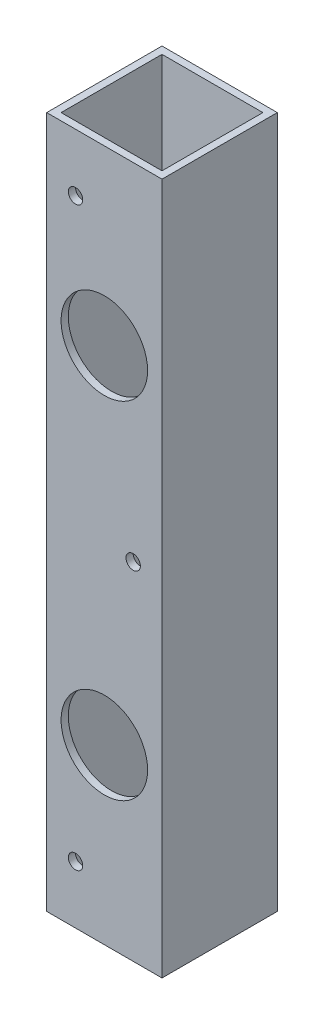
ISO-10303-21;
HEADER;
FILE_DESCRIPTION(('STEP AP214'),'2;1');
FILE_NAME('part.step','',(''),(''),'','','');
FILE_SCHEMA(('AUTOMOTIVE_DESIGN { 1 0 10303 214 1 1 1 1 }'));
ENDSEC;
DATA;
#1=APPLICATION_CONTEXT('core data for automotive mechanical design processes');
#2=APPLICATION_PROTOCOL_DEFINITION('international standard','automotive_design',2000,#1);
#3=PRODUCT_CONTEXT('',#1,'mechanical');
#4=PRODUCT('Part','Part','',(#3));
#5=PRODUCT_RELATED_PRODUCT_CATEGORY('part','',(#4));
#6=PRODUCT_DEFINITION_FORMATION('','',#4);
#7=PRODUCT_DEFINITION_CONTEXT('part definition',#1,'design');
#8=PRODUCT_DEFINITION('design','',#6,#7);
#9=PRODUCT_DEFINITION_SHAPE('','',#8);
#10=(LENGTH_UNIT() NAMED_UNIT(*) SI_UNIT(.MILLI.,.METRE.));
#11=(NAMED_UNIT(*) PLANE_ANGLE_UNIT() SI_UNIT($,.RADIAN.));
#12=(NAMED_UNIT(*) SI_UNIT($,.STERADIAN.) SOLID_ANGLE_UNIT());
#13=UNCERTAINTY_MEASURE_WITH_UNIT(LENGTH_MEASURE(1.E-05),#10,'distance_accuracy_value','');
#14=(GEOMETRIC_REPRESENTATION_CONTEXT(3) GLOBAL_UNCERTAINTY_ASSIGNED_CONTEXT((#13)) GLOBAL_UNIT_ASSIGNED_CONTEXT((#10,
#11,#12)) REPRESENTATION_CONTEXT('',''));
#15=CARTESIAN_POINT('',(0.,0.,0.));
#16=DIRECTION('',(0.,0.,1.));
#17=DIRECTION('',(1.,0.,0.));
#18=AXIS2_PLACEMENT_3D('',#15,#16,#17);
#19=CARTESIAN_POINT('',(0.,152.4,0.));
#20=DIRECTION('',(0.,1.,0.));
#21=DIRECTION('',(0.,0.,1.));
#22=AXIS2_PLACEMENT_3D('',#19,#20,#21);
#23=PLANE('',#22);
#24=DIRECTION('',(0.,0.,1.));
#25=VECTOR('',#24,1.);
#26=CARTESIAN_POINT('',(-12.7,152.4,12.7));
#27=LINE('',#26,#25);
#28=CARTESIAN_POINT('',(-12.7,152.4,-12.7));
#29=VERTEX_POINT('',#28);
#30=CARTESIAN_POINT('',(-12.7,152.4,12.7));
#31=VERTEX_POINT('',#30);
#32=EDGE_CURVE('E159',#29,#31,#27,.T.);
#33=ORIENTED_EDGE('',*,*,#32,.T.);
#34=DIRECTION('',(1.,0.,0.));
#35=VECTOR('',#34,1.);
#36=CARTESIAN_POINT('',(12.7,152.4,12.7));
#37=LINE('',#36,#35);
#38=CARTESIAN_POINT('',(12.7,152.4,12.7));
#39=VERTEX_POINT('',#38);
#40=EDGE_CURVE('E162',#31,#39,#37,.T.);
#41=ORIENTED_EDGE('',*,*,#40,.T.);
#42=DIRECTION('',(0.,0.,-1.));
#43=VECTOR('',#42,1.);
#44=CARTESIAN_POINT('',(12.7,152.4,12.7));
#45=LINE('',#44,#43);
#46=CARTESIAN_POINT('',(12.7,152.4,-12.7));
#47=VERTEX_POINT('',#46);
#48=EDGE_CURVE('E165',#39,#47,#45,.T.);
#49=ORIENTED_EDGE('',*,*,#48,.T.);
#50=DIRECTION('',(-1.,0.,0.));
#51=VECTOR('',#50,1.);
#52=CARTESIAN_POINT('',(12.7,152.4,-12.7));
#53=LINE('',#52,#51);
#54=EDGE_CURVE('E167',#47,#29,#53,.T.);
#55=ORIENTED_EDGE('',*,*,#54,.T.);
#56=EDGE_LOOP('',(#33,#41,#49,#55));
#57=FACE_BOUND('',#56,.T.);
#58=DIRECTION('',(1.,0.,0.));
#59=VECTOR('',#58,1.);
#60=CARTESIAN_POINT('',(12.7,152.4,11.1125));
#61=LINE('',#60,#59);
#62=CARTESIAN_POINT('',(-11.1125,152.4,11.1125));
#63=VERTEX_POINT('',#62);
#64=CARTESIAN_POINT('',(11.1125,152.4,11.1125));
#65=VERTEX_POINT('',#64);
#66=EDGE_CURVE('E129',#63,#65,#61,.T.);
#67=ORIENTED_EDGE('',*,*,#66,.F.);
#68=DIRECTION('',(0.,0.,1.));
#69=VECTOR('',#68,1.);
#70=CARTESIAN_POINT('',(-11.1125,152.4,12.7));
#71=LINE('',#70,#69);
#72=CARTESIAN_POINT('',(-11.1125,152.4,-11.1125));
#73=VERTEX_POINT('',#72);
#74=EDGE_CURVE('E121',#73,#63,#71,.T.);
#75=ORIENTED_EDGE('',*,*,#74,.F.);
#76=DIRECTION('',(-1.,0.,0.));
#77=VECTOR('',#76,1.);
#78=CARTESIAN_POINT('',(12.7,152.4,-11.1125));
#79=LINE('',#78,#77);
#80=CARTESIAN_POINT('',(11.1125,152.4,-11.1125));
#81=VERTEX_POINT('',#80);
#82=EDGE_CURVE('E143',#81,#73,#79,.T.);
#83=ORIENTED_EDGE('',*,*,#82,.F.);
#84=DIRECTION('',(0.,0.,-1.));
#85=VECTOR('',#84,1.);
#86=CARTESIAN_POINT('',(11.1125,152.4,12.7));
#87=LINE('',#86,#85);
#88=EDGE_CURVE('E141',#65,#81,#87,.T.);
#89=ORIENTED_EDGE('',*,*,#88,.F.);
#90=EDGE_LOOP('',(#67,#75,#83,#89));
#91=FACE_BOUND('',#90,.T.);
#92=ADVANCED_FACE('F56',(#57,#91),#23,.T.);
#93=CARTESIAN_POINT('',(0.,0.,0.));
#94=DIRECTION('',(0.,1.,0.));
#95=DIRECTION('',(0.,0.,1.));
#96=AXIS2_PLACEMENT_3D('',#93,#94,#95);
#97=PLANE('',#96);
#98=DIRECTION('',(0.,0.,1.));
#99=VECTOR('',#98,1.);
#100=CARTESIAN_POINT('',(-12.7,0.,12.7));
#101=LINE('',#100,#99);
#102=CARTESIAN_POINT('',(-12.7,0.,-12.7));
#103=VERTEX_POINT('',#102);
#104=CARTESIAN_POINT('',(-12.7,0.,12.7));
#105=VERTEX_POINT('',#104);
#106=EDGE_CURVE('E137',#103,#105,#101,.T.);
#107=ORIENTED_EDGE('',*,*,#106,.F.);
#108=DIRECTION('',(-1.,0.,0.));
#109=VECTOR('',#108,1.);
#110=CARTESIAN_POINT('',(12.7,0.,-12.7));
#111=LINE('',#110,#109);
#112=CARTESIAN_POINT('',(12.7,0.,-12.7));
#113=VERTEX_POINT('',#112);
#114=EDGE_CURVE('E163',#113,#103,#111,.T.);
#115=ORIENTED_EDGE('',*,*,#114,.F.);
#116=DIRECTION('',(0.,0.,-1.));
#117=VECTOR('',#116,1.);
#118=CARTESIAN_POINT('',(12.7,0.,12.7));
#119=LINE('',#118,#117);
#120=CARTESIAN_POINT('',(12.7,0.,12.7));
#121=VERTEX_POINT('',#120);
#122=EDGE_CURVE('E174',#121,#113,#119,.T.);
#123=ORIENTED_EDGE('',*,*,#122,.F.);
#124=DIRECTION('',(1.,0.,0.));
#125=VECTOR('',#124,1.);
#126=CARTESIAN_POINT('',(12.7,0.,12.7));
#127=LINE('',#126,#125);
#128=EDGE_CURVE('E172',#105,#121,#127,.T.);
#129=ORIENTED_EDGE('',*,*,#128,.F.);
#130=EDGE_LOOP('',(#107,#115,#123,#129));
#131=FACE_BOUND('',#130,.T.);
#132=DIRECTION('',(0.,0.,1.));
#133=VECTOR('',#132,1.);
#134=CARTESIAN_POINT('',(-11.1125,0.,12.7));
#135=LINE('',#134,#133);
#136=CARTESIAN_POINT('',(-11.1125,0.,-11.1125));
#137=VERTEX_POINT('',#136);
#138=CARTESIAN_POINT('',(-11.1125,0.,11.1125));
#139=VERTEX_POINT('',#138);
#140=EDGE_CURVE('E79',#137,#139,#135,.T.);
#141=ORIENTED_EDGE('',*,*,#140,.T.);
#142=DIRECTION('',(1.,0.,0.));
#143=VECTOR('',#142,1.);
#144=CARTESIAN_POINT('',(12.7,0.,11.1125));
#145=LINE('',#144,#143);
#146=CARTESIAN_POINT('',(11.1125,0.,11.1125));
#147=VERTEX_POINT('',#146);
#148=EDGE_CURVE('E136',#139,#147,#145,.T.);
#149=ORIENTED_EDGE('',*,*,#148,.T.);
#150=DIRECTION('',(0.,0.,-1.));
#151=VECTOR('',#150,1.);
#152=CARTESIAN_POINT('',(11.1125,0.,12.7));
#153=LINE('',#152,#151);
#154=CARTESIAN_POINT('',(11.1125,0.,-11.1125));
#155=VERTEX_POINT('',#154);
#156=EDGE_CURVE('E151',#147,#155,#153,.T.);
#157=ORIENTED_EDGE('',*,*,#156,.T.);
#158=DIRECTION('',(-1.,0.,0.));
#159=VECTOR('',#158,1.);
#160=CARTESIAN_POINT('',(12.7,0.,-11.1125));
#161=LINE('',#160,#159);
#162=EDGE_CURVE('E130',#155,#137,#161,.T.);
#163=ORIENTED_EDGE('',*,*,#162,.T.);
#164=EDGE_LOOP('',(#141,#149,#157,#163));
#165=FACE_BOUND('',#164,.T.);
#166=ADVANCED_FACE('F192',(#131,#165),#97,.F.);
#167=CARTESIAN_POINT('',(-12.7,152.4,12.7));
#168=DIRECTION('',(1.,0.,0.));
#169=DIRECTION('',(0.,0.,-1.));
#170=AXIS2_PLACEMENT_3D('',#167,#168,#169);
#171=PLANE('',#170);
#172=ORIENTED_EDGE('',*,*,#106,.T.);
#173=DIRECTION('',(0.,-1.,0.));
#174=VECTOR('',#173,1.);
#175=CARTESIAN_POINT('',(-12.7,152.4,12.7));
#176=LINE('',#175,#174);
#177=EDGE_CURVE('E12',#31,#105,#176,.T.);
#178=ORIENTED_EDGE('',*,*,#177,.F.);
#179=ORIENTED_EDGE('',*,*,#32,.F.);
#180=DIRECTION('',(0.,-1.,0.));
#181=VECTOR('',#180,1.);
#182=CARTESIAN_POINT('',(-12.7,152.4,-12.7));
#183=LINE('',#182,#181);
#184=EDGE_CURVE('E169',#29,#103,#183,.T.);
#185=ORIENTED_EDGE('',*,*,#184,.T.);
#186=EDGE_LOOP('',(#172,#178,#179,#185));
#187=FACE_BOUND('',#186,.T.);
#188=ADVANCED_FACE('F58',(#187),#171,.F.);
#189=CARTESIAN_POINT('',(12.7,152.4,12.7));
#190=DIRECTION('',(0.,0.,-1.));
#191=DIRECTION('',(-1.,0.,0.));
#192=AXIS2_PLACEMENT_3D('',#189,#190,#191);
#193=PLANE('',#192);
#194=CARTESIAN_POINT('',(0.,38.1,12.7));
#195=DIRECTION('',(0.,0.,1.));
#196=DIRECTION('',(1.,0.,0.));
#197=AXIS2_PLACEMENT_3D('',#194,#195,#196);
#198=CIRCLE('',#197,9.525);
#199=CARTESIAN_POINT('',(9.525,38.1,12.7));
#200=VERTEX_POINT('',#199);
#201=EDGE_CURVE('E259',#200,#200,#198,.T.);
#202=ORIENTED_EDGE('',*,*,#201,.F.);
#203=EDGE_LOOP('',(#202));
#204=FACE_BOUND('',#203,.T.);
#205=CARTESIAN_POINT('',(-6.35,139.7,12.7));
#206=DIRECTION('',(0.,0.,1.));
#207=DIRECTION('',(1.,0.,0.));
#208=AXIS2_PLACEMENT_3D('',#205,#206,#207);
#209=CIRCLE('',#208,1.5875);
#210=CARTESIAN_POINT('',(-4.7625,139.7,12.7));
#211=VERTEX_POINT('',#210);
#212=EDGE_CURVE('E260',#211,#211,#209,.T.);
#213=ORIENTED_EDGE('',*,*,#212,.F.);
#214=EDGE_LOOP('',(#213));
#215=FACE_BOUND('',#214,.T.);
#216=CARTESIAN_POINT('',(6.35,76.2,12.7));
#217=DIRECTION('',(0.,0.,1.));
#218=DIRECTION('',(1.,0.,0.));
#219=AXIS2_PLACEMENT_3D('',#216,#217,#218);
#220=CIRCLE('',#219,1.5875);
#221=CARTESIAN_POINT('',(7.9375,76.2,12.7));
#222=VERTEX_POINT('',#221);
#223=EDGE_CURVE('E246',#222,#222,#220,.T.);
#224=ORIENTED_EDGE('',*,*,#223,.F.);
#225=EDGE_LOOP('',(#224));
#226=FACE_BOUND('',#225,.T.);
#227=CARTESIAN_POINT('',(-6.35,12.7,12.7));
#228=DIRECTION('',(0.,0.,1.));
#229=DIRECTION('',(1.,0.,0.));
#230=AXIS2_PLACEMENT_3D('',#227,#228,#229);
#231=CIRCLE('',#230,1.5875);
#232=CARTESIAN_POINT('',(-4.7625,12.7,12.7));
#233=VERTEX_POINT('',#232);
#234=EDGE_CURVE('E247',#233,#233,#231,.T.);
#235=ORIENTED_EDGE('',*,*,#234,.F.);
#236=EDGE_LOOP('',(#235));
#237=FACE_BOUND('',#236,.T.);
#238=CARTESIAN_POINT('',(0.,114.3,12.7));
#239=DIRECTION('',(0.,0.,1.));
#240=DIRECTION('',(1.,0.,0.));
#241=AXIS2_PLACEMENT_3D('',#238,#239,#240);
#242=CIRCLE('',#241,9.525);
#243=CARTESIAN_POINT('',(9.525,114.3,12.7));
#244=VERTEX_POINT('',#243);
#245=EDGE_CURVE('E149',#244,#244,#242,.T.);
#246=ORIENTED_EDGE('',*,*,#245,.F.);
#247=EDGE_LOOP('',(#246));
#248=FACE_BOUND('',#247,.T.);
#249=ORIENTED_EDGE('',*,*,#128,.T.);
#250=DIRECTION('',(0.,-1.,0.));
#251=VECTOR('',#250,1.);
#252=CARTESIAN_POINT('',(12.7,152.4,12.7));
#253=LINE('',#252,#251);
#254=EDGE_CURVE('E64',#39,#121,#253,.T.);
#255=ORIENTED_EDGE('',*,*,#254,.F.);
#256=ORIENTED_EDGE('',*,*,#40,.F.);
#257=ORIENTED_EDGE('',*,*,#177,.T.);
#258=EDGE_LOOP('',(#249,#255,#256,#257));
#259=FACE_BOUND('',#258,.T.);
#260=ADVANCED_FACE('F202',(#204,#215,#226,#237,#248,#259),#193,.F.);
#261=CARTESIAN_POINT('',(12.7,152.4,12.7));
#262=DIRECTION('',(-1.,0.,0.));
#263=DIRECTION('',(0.,0.,1.));
#264=AXIS2_PLACEMENT_3D('',#261,#262,#263);
#265=PLANE('',#264);
#266=ORIENTED_EDGE('',*,*,#122,.T.);
#267=DIRECTION('',(0.,-1.,0.));
#268=VECTOR('',#267,1.);
#269=CARTESIAN_POINT('',(12.7,152.4,-12.7));
#270=LINE('',#269,#268);
#271=EDGE_CURVE('E179',#47,#113,#270,.T.);
#272=ORIENTED_EDGE('',*,*,#271,.F.);
#273=ORIENTED_EDGE('',*,*,#48,.F.);
#274=ORIENTED_EDGE('',*,*,#254,.T.);
#275=EDGE_LOOP('',(#266,#272,#273,#274));
#276=FACE_BOUND('',#275,.T.);
#277=ADVANCED_FACE('F186',(#276),#265,.F.);
#278=CARTESIAN_POINT('',(12.7,152.4,-12.7));
#279=DIRECTION('',(0.,0.,1.));
#280=DIRECTION('',(1.,0.,0.));
#281=AXIS2_PLACEMENT_3D('',#278,#279,#280);
#282=PLANE('',#281);
#283=CARTESIAN_POINT('',(0.,114.3,-12.7));
#284=DIRECTION('',(0.,0.,1.));
#285=DIRECTION('',(1.,0.,0.));
#286=AXIS2_PLACEMENT_3D('',#283,#284,#285);
#287=CIRCLE('',#286,3.3782);
#288=CARTESIAN_POINT('',(3.3782,114.3,-12.7));
#289=VERTEX_POINT('',#288);
#290=EDGE_CURVE('E229',#289,#289,#287,.T.);
#291=ORIENTED_EDGE('',*,*,#290,.T.);
#292=EDGE_LOOP('',(#291));
#293=FACE_BOUND('',#292,.T.);
#294=CARTESIAN_POINT('',(0.,38.1,-12.7));
#295=DIRECTION('',(0.,0.,1.));
#296=DIRECTION('',(1.,0.,0.));
#297=AXIS2_PLACEMENT_3D('',#294,#295,#296);
#298=CIRCLE('',#297,3.3782);
#299=CARTESIAN_POINT('',(3.3782,38.1,-12.7));
#300=VERTEX_POINT('',#299);
#301=EDGE_CURVE('E232',#300,#300,#298,.T.);
#302=ORIENTED_EDGE('',*,*,#301,.T.);
#303=EDGE_LOOP('',(#302));
#304=FACE_BOUND('',#303,.T.);
#305=ORIENTED_EDGE('',*,*,#114,.T.);
#306=ORIENTED_EDGE('',*,*,#184,.F.);
#307=ORIENTED_EDGE('',*,*,#54,.F.);
#308=ORIENTED_EDGE('',*,*,#271,.T.);
#309=EDGE_LOOP('',(#305,#306,#307,#308));
#310=FACE_BOUND('',#309,.T.);
#311=ADVANCED_FACE('F196',(#293,#304,#310),#282,.F.);
#312=CARTESIAN_POINT('',(-11.1125,152.4,12.7));
#313=DIRECTION('',(1.,0.,0.));
#314=DIRECTION('',(0.,0.,-1.));
#315=AXIS2_PLACEMENT_3D('',#312,#313,#314);
#316=PLANE('',#315);
#317=ORIENTED_EDGE('',*,*,#140,.F.);
#318=DIRECTION('',(0.,-1.,0.));
#319=VECTOR('',#318,1.);
#320=CARTESIAN_POINT('',(-11.1125,152.4,-11.1125));
#321=LINE('',#320,#319);
#322=EDGE_CURVE('E125',#73,#137,#321,.T.);
#323=ORIENTED_EDGE('',*,*,#322,.F.);
#324=ORIENTED_EDGE('',*,*,#74,.T.);
#325=DIRECTION('',(0.,-1.,0.));
#326=VECTOR('',#325,1.);
#327=CARTESIAN_POINT('',(-11.1125,152.4,11.1125));
#328=LINE('',#327,#326);
#329=EDGE_CURVE('E124',#63,#139,#328,.T.);
#330=ORIENTED_EDGE('',*,*,#329,.T.);
#331=EDGE_LOOP('',(#317,#323,#324,#330));
#332=FACE_BOUND('',#331,.T.);
#333=ADVANCED_FACE('F123',(#332),#316,.T.);
#334=CARTESIAN_POINT('',(12.7,152.4,11.1125));
#335=DIRECTION('',(0.,0.,-1.));
#336=DIRECTION('',(-1.,0.,0.));
#337=AXIS2_PLACEMENT_3D('',#334,#335,#336);
#338=PLANE('',#337);
#339=CARTESIAN_POINT('',(0.,38.1,11.1125));
#340=DIRECTION('',(0.,0.,-1.));
#341=DIRECTION('',(-1.,0.,0.));
#342=AXIS2_PLACEMENT_3D('',#339,#340,#341);
#343=CIRCLE('',#342,9.525);
#344=CARTESIAN_POINT('',(-9.525,38.1,11.1125));
#345=VERTEX_POINT('',#344);
#346=EDGE_CURVE('E256',#345,#345,#343,.F.);
#347=ORIENTED_EDGE('',*,*,#346,.T.);
#348=EDGE_LOOP('',(#347));
#349=FACE_BOUND('',#348,.T.);
#350=CARTESIAN_POINT('',(-6.35,139.7,11.1125));
#351=DIRECTION('',(0.,0.,-1.));
#352=DIRECTION('',(-1.,0.,0.));
#353=AXIS2_PLACEMENT_3D('',#350,#351,#352);
#354=CIRCLE('',#353,1.5875);
#355=CARTESIAN_POINT('',(-7.93750000000001,139.7,11.1125));
#356=VERTEX_POINT('',#355);
#357=EDGE_CURVE('E250',#356,#356,#354,.F.);
#358=ORIENTED_EDGE('',*,*,#357,.T.);
#359=EDGE_LOOP('',(#358));
#360=FACE_BOUND('',#359,.T.);
#361=CARTESIAN_POINT('',(6.35,76.2,11.1125));
#362=DIRECTION('',(0.,0.,-1.));
#363=DIRECTION('',(-1.,0.,0.));
#364=AXIS2_PLACEMENT_3D('',#361,#362,#363);
#365=CIRCLE('',#364,1.5875);
#366=CARTESIAN_POINT('',(4.7625,76.2,11.1125));
#367=VERTEX_POINT('',#366);
#368=EDGE_CURVE('E243',#367,#367,#365,.F.);
#369=ORIENTED_EDGE('',*,*,#368,.T.);
#370=EDGE_LOOP('',(#369));
#371=FACE_BOUND('',#370,.T.);
#372=CARTESIAN_POINT('',(-6.35,12.7,11.1125));
#373=DIRECTION('',(0.,0.,-1.));
#374=DIRECTION('',(-1.,0.,0.));
#375=AXIS2_PLACEMENT_3D('',#372,#373,#374);
#376=CIRCLE('',#375,1.5875);
#377=CARTESIAN_POINT('',(-7.93750000000001,12.7,11.1125));
#378=VERTEX_POINT('',#377);
#379=EDGE_CURVE('E251',#378,#378,#376,.F.);
#380=ORIENTED_EDGE('',*,*,#379,.T.);
#381=EDGE_LOOP('',(#380));
#382=FACE_BOUND('',#381,.T.);
#383=CARTESIAN_POINT('',(0.,114.3,11.1125));
#384=DIRECTION('',(0.,0.,-1.));
#385=DIRECTION('',(-1.,0.,0.));
#386=AXIS2_PLACEMENT_3D('',#383,#384,#385);
#387=CIRCLE('',#386,9.525);
#388=CARTESIAN_POINT('',(-9.525,114.3,11.1125));
#389=VERTEX_POINT('',#388);
#390=EDGE_CURVE('E263',#389,#389,#387,.F.);
#391=ORIENTED_EDGE('',*,*,#390,.T.);
#392=EDGE_LOOP('',(#391));
#393=FACE_BOUND('',#392,.T.);
#394=ORIENTED_EDGE('',*,*,#148,.F.);
#395=ORIENTED_EDGE('',*,*,#329,.F.);
#396=ORIENTED_EDGE('',*,*,#66,.T.);
#397=DIRECTION('',(0.,-1.,0.));
#398=VECTOR('',#397,1.);
#399=CARTESIAN_POINT('',(11.1125,152.4,11.1125));
#400=LINE('',#399,#398);
#401=EDGE_CURVE('E138',#65,#147,#400,.T.);
#402=ORIENTED_EDGE('',*,*,#401,.T.);
#403=EDGE_LOOP('',(#394,#395,#396,#402));
#404=FACE_BOUND('',#403,.T.);
#405=ADVANCED_FACE('F133',(#349,#360,#371,#382,#393,#404),#338,.T.);
#406=CARTESIAN_POINT('',(11.1125,152.4,12.7));
#407=DIRECTION('',(-1.,0.,0.));
#408=DIRECTION('',(0.,0.,1.));
#409=AXIS2_PLACEMENT_3D('',#406,#407,#408);
#410=PLANE('',#409);
#411=ORIENTED_EDGE('',*,*,#156,.F.);
#412=ORIENTED_EDGE('',*,*,#401,.F.);
#413=ORIENTED_EDGE('',*,*,#88,.T.);
#414=DIRECTION('',(0.,-1.,0.));
#415=VECTOR('',#414,1.);
#416=CARTESIAN_POINT('',(11.1125,152.4,-11.1125));
#417=LINE('',#416,#415);
#418=EDGE_CURVE('E71',#81,#155,#417,.T.);
#419=ORIENTED_EDGE('',*,*,#418,.T.);
#420=EDGE_LOOP('',(#411,#412,#413,#419));
#421=FACE_BOUND('',#420,.T.);
#422=ADVANCED_FACE('F286',(#421),#410,.T.);
#423=CARTESIAN_POINT('',(12.7,152.4,-11.1125));
#424=DIRECTION('',(0.,0.,1.));
#425=DIRECTION('',(1.,0.,0.));
#426=AXIS2_PLACEMENT_3D('',#423,#424,#425);
#427=PLANE('',#426);
#428=CARTESIAN_POINT('',(0.,114.3,-11.1125));
#429=DIRECTION('',(0.,0.,1.));
#430=DIRECTION('',(1.,0.,0.));
#431=AXIS2_PLACEMENT_3D('',#428,#429,#430);
#432=CIRCLE('',#431,3.3782);
#433=CARTESIAN_POINT('',(3.3782,114.3,-11.1125));
#434=VERTEX_POINT('',#433);
#435=EDGE_CURVE('E234',#434,#434,#432,.T.);
#436=ORIENTED_EDGE('',*,*,#435,.F.);
#437=EDGE_LOOP('',(#436));
#438=FACE_BOUND('',#437,.T.);
#439=CARTESIAN_POINT('',(0.,38.1,-11.1125));
#440=DIRECTION('',(0.,0.,1.));
#441=DIRECTION('',(1.,0.,0.));
#442=AXIS2_PLACEMENT_3D('',#439,#440,#441);
#443=CIRCLE('',#442,3.3782);
#444=CARTESIAN_POINT('',(3.3782,38.1,-11.1125));
#445=VERTEX_POINT('',#444);
#446=EDGE_CURVE('E235',#445,#445,#443,.T.);
#447=ORIENTED_EDGE('',*,*,#446,.F.);
#448=EDGE_LOOP('',(#447));
#449=FACE_BOUND('',#448,.T.);
#450=ORIENTED_EDGE('',*,*,#162,.F.);
#451=ORIENTED_EDGE('',*,*,#418,.F.);
#452=ORIENTED_EDGE('',*,*,#82,.T.);
#453=ORIENTED_EDGE('',*,*,#322,.T.);
#454=EDGE_LOOP('',(#450,#451,#452,#453));
#455=FACE_BOUND('',#454,.T.);
#456=ADVANCED_FACE('F276',(#438,#449,#455),#427,.T.);
#457=CARTESIAN_POINT('',(0.,114.3,-12.701));
#458=DIRECTION('',(0.,0.,1.));
#459=DIRECTION('',(1.,0.,0.));
#460=AXIS2_PLACEMENT_3D('',#457,#458,#459);
#461=CYLINDRICAL_SURFACE('',#460,9.525);
#462=ORIENTED_EDGE('',*,*,#390,.F.);
#463=EDGE_LOOP('',(#462));
#464=FACE_BOUND('',#463,.T.);
#465=ORIENTED_EDGE('',*,*,#245,.T.);
#466=EDGE_LOOP('',(#465));
#467=FACE_BOUND('',#466,.T.);
#468=ADVANCED_FACE('F272',(#464,#467),#461,.F.);
#469=CARTESIAN_POINT('',(-6.35,12.7,-12.701));
#470=DIRECTION('',(0.,0.,1.));
#471=DIRECTION('',(1.,0.,0.));
#472=AXIS2_PLACEMENT_3D('',#469,#470,#471);
#473=CYLINDRICAL_SURFACE('',#472,1.5875);
#474=ORIENTED_EDGE('',*,*,#379,.F.);
#475=EDGE_LOOP('',(#474));
#476=FACE_BOUND('',#475,.T.);
#477=ORIENTED_EDGE('',*,*,#234,.T.);
#478=EDGE_LOOP('',(#477));
#479=FACE_BOUND('',#478,.T.);
#480=ADVANCED_FACE('F275',(#476,#479),#473,.F.);
#481=CARTESIAN_POINT('',(6.35,76.2,-12.701));
#482=DIRECTION('',(0.,0.,1.));
#483=DIRECTION('',(1.,0.,0.));
#484=AXIS2_PLACEMENT_3D('',#481,#482,#483);
#485=CYLINDRICAL_SURFACE('',#484,1.5875);
#486=ORIENTED_EDGE('',*,*,#368,.F.);
#487=EDGE_LOOP('',(#486));
#488=FACE_BOUND('',#487,.T.);
#489=ORIENTED_EDGE('',*,*,#223,.T.);
#490=EDGE_LOOP('',(#489));
#491=FACE_BOUND('',#490,.T.);
#492=ADVANCED_FACE('F283',(#488,#491),#485,.F.);
#493=CARTESIAN_POINT('',(-6.35,139.7,-12.701));
#494=DIRECTION('',(0.,0.,1.));
#495=DIRECTION('',(1.,0.,0.));
#496=AXIS2_PLACEMENT_3D('',#493,#494,#495);
#497=CYLINDRICAL_SURFACE('',#496,1.5875);
#498=ORIENTED_EDGE('',*,*,#357,.F.);
#499=EDGE_LOOP('',(#498));
#500=FACE_BOUND('',#499,.T.);
#501=ORIENTED_EDGE('',*,*,#212,.T.);
#502=EDGE_LOOP('',(#501));
#503=FACE_BOUND('',#502,.T.);
#504=ADVANCED_FACE('F291',(#500,#503),#497,.F.);
#505=CARTESIAN_POINT('',(0.,38.1,-12.701));
#506=DIRECTION('',(0.,0.,1.));
#507=DIRECTION('',(1.,0.,0.));
#508=AXIS2_PLACEMENT_3D('',#505,#506,#507);
#509=CYLINDRICAL_SURFACE('',#508,9.525);
#510=ORIENTED_EDGE('',*,*,#346,.F.);
#511=EDGE_LOOP('',(#510));
#512=FACE_BOUND('',#511,.T.);
#513=ORIENTED_EDGE('',*,*,#201,.T.);
#514=EDGE_LOOP('',(#513));
#515=FACE_BOUND('',#514,.T.);
#516=ADVANCED_FACE('F320',(#512,#515),#509,.F.);
#517=CARTESIAN_POINT('',(0.,38.1,-12.7));
#518=DIRECTION('',(0.,0.,1.));
#519=DIRECTION('',(1.,0.,0.));
#520=AXIS2_PLACEMENT_3D('',#517,#518,#519);
#521=CYLINDRICAL_SURFACE('',#520,3.3782);
#522=ORIENTED_EDGE('',*,*,#301,.F.);
#523=EDGE_LOOP('',(#522));
#524=FACE_BOUND('',#523,.T.);
#525=ORIENTED_EDGE('',*,*,#446,.T.);
#526=EDGE_LOOP('',(#525));
#527=FACE_BOUND('',#526,.T.);
#528=ADVANCED_FACE('F323',(#524,#527),#521,.F.);
#529=CARTESIAN_POINT('',(0.,114.3,-12.7));
#530=DIRECTION('',(0.,0.,1.));
#531=DIRECTION('',(1.,0.,0.));
#532=AXIS2_PLACEMENT_3D('',#529,#530,#531);
#533=CYLINDRICAL_SURFACE('',#532,3.3782);
#534=ORIENTED_EDGE('',*,*,#290,.F.);
#535=EDGE_LOOP('',(#534));
#536=FACE_BOUND('',#535,.T.);
#537=ORIENTED_EDGE('',*,*,#435,.T.);
#538=EDGE_LOOP('',(#537));
#539=FACE_BOUND('',#538,.T.);
#540=ADVANCED_FACE('F330',(#536,#539),#533,.F.);
#541=CLOSED_SHELL('',(#92,#166,#188,#260,#277,#311,#333,#405,#422,#456,#468,#480,#492,#504,#516,
#528,#540));
#542=MANIFOLD_SOLID_BREP('B2',#541);
#543=ADVANCED_BREP_SHAPE_REPRESENTATION('',(#18,#542),#14);
#544=SHAPE_DEFINITION_REPRESENTATION(#9,#543);
ENDSEC;
END-ISO-10303-21;
